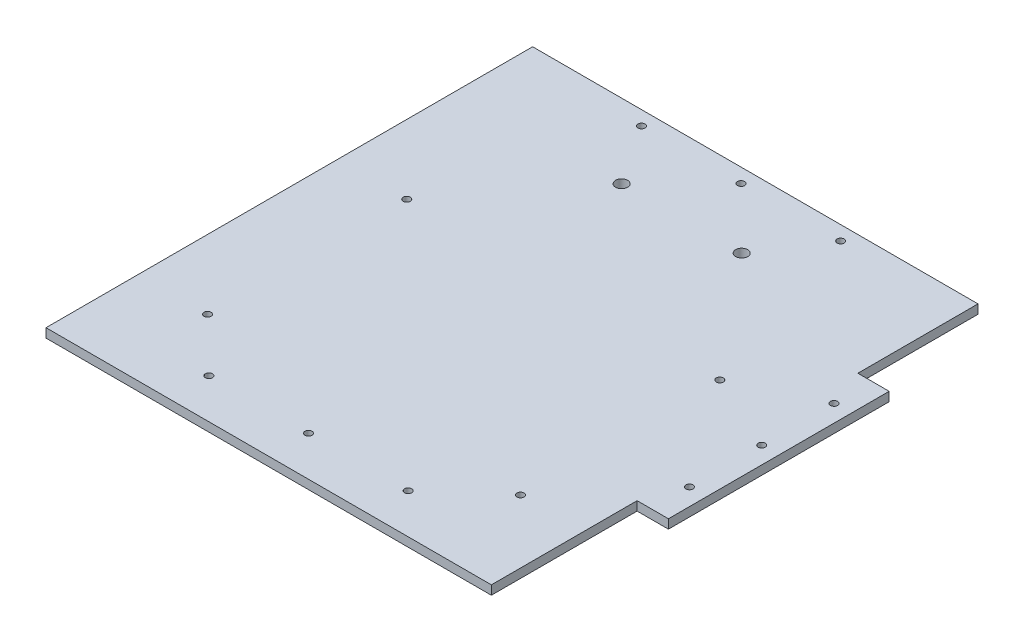
ISO-10303-21;
HEADER;
FILE_DESCRIPTION(('STEP AP214'),'2;1');
FILE_NAME('part.step','',(''),(''),'','','');
FILE_SCHEMA(('AUTOMOTIVE_DESIGN { 1 0 10303 214 1 1 1 1 }'));
ENDSEC;
DATA;
#1=APPLICATION_CONTEXT('core data for automotive mechanical design processes');
#2=APPLICATION_PROTOCOL_DEFINITION('international standard','automotive_design',2000,#1);
#3=PRODUCT_CONTEXT('',#1,'mechanical');
#4=PRODUCT('Part','Part','',(#3));
#5=PRODUCT_RELATED_PRODUCT_CATEGORY('part','',(#4));
#6=PRODUCT_DEFINITION_FORMATION('','',#4);
#7=PRODUCT_DEFINITION_CONTEXT('part definition',#1,'design');
#8=PRODUCT_DEFINITION('design','',#6,#7);
#9=PRODUCT_DEFINITION_SHAPE('','',#8);
#10=(LENGTH_UNIT() NAMED_UNIT(*) SI_UNIT(.MILLI.,.METRE.));
#11=(NAMED_UNIT(*) PLANE_ANGLE_UNIT() SI_UNIT($,.RADIAN.));
#12=(NAMED_UNIT(*) SI_UNIT($,.STERADIAN.) SOLID_ANGLE_UNIT());
#13=UNCERTAINTY_MEASURE_WITH_UNIT(LENGTH_MEASURE(1.E-05),#10,'distance_accuracy_value','');
#14=(GEOMETRIC_REPRESENTATION_CONTEXT(3) GLOBAL_UNCERTAINTY_ASSIGNED_CONTEXT((#13)) GLOBAL_UNIT_ASSIGNED_CONTEXT((#10,
#11,#12)) REPRESENTATION_CONTEXT('',''));
#15=CARTESIAN_POINT('',(0.,0.,0.));
#16=DIRECTION('',(0.,0.,1.));
#17=DIRECTION('',(1.,0.,0.));
#18=AXIS2_PLACEMENT_3D('',#15,#16,#17);
#19=CARTESIAN_POINT('',(156.499999999998,-6.35,171.));
#20=DIRECTION('',(1.,0.,0.));
#21=DIRECTION('',(0.,0.,-1.));
#22=AXIS2_PLACEMENT_3D('',#19,#20,#21);
#23=PLANE('',#22);
#24=DIRECTION('',(0.,0.,-1.));
#25=VECTOR('',#24,1.);
#26=CARTESIAN_POINT('',(156.499999999998,-6.35,171.));
#27=LINE('',#26,#25);
#28=CARTESIAN_POINT('',(156.499999999998,-6.35,171.));
#29=VERTEX_POINT('',#28);
#30=CARTESIAN_POINT('',(156.499999999998,-6.35,68.570201764885));
#31=VERTEX_POINT('',#30);
#32=EDGE_CURVE('E147',#29,#31,#27,.T.);
#33=ORIENTED_EDGE('',*,*,#32,.T.);
#34=DIRECTION('',(0.,1.,0.));
#35=VECTOR('',#34,1.);
#36=CARTESIAN_POINT('',(156.499999999998,-6.35,68.570201764885));
#37=LINE('',#36,#35);
#38=CARTESIAN_POINT('',(156.499999999998,0.,68.570201764885));
#39=VERTEX_POINT('',#38);
#40=EDGE_CURVE('E129',#31,#39,#37,.T.);
#41=ORIENTED_EDGE('',*,*,#40,.T.);
#42=DIRECTION('',(0.,0.,-1.));
#43=VECTOR('',#42,1.);
#44=CARTESIAN_POINT('',(156.499999999998,0.,171.));
#45=LINE('',#44,#43);
#46=CARTESIAN_POINT('',(156.499999999998,0.,171.));
#47=VERTEX_POINT('',#46);
#48=EDGE_CURVE('E157',#47,#39,#45,.T.);
#49=ORIENTED_EDGE('',*,*,#48,.F.);
#50=DIRECTION('',(0.,1.,0.));
#51=VECTOR('',#50,1.);
#52=CARTESIAN_POINT('',(156.499999999998,-6.35,171.));
#53=LINE('',#52,#51);
#54=EDGE_CURVE('E11',#29,#47,#53,.T.);
#55=ORIENTED_EDGE('',*,*,#54,.F.);
#56=EDGE_LOOP('',(#33,#41,#49,#55));
#57=FACE_BOUND('',#56,.T.);
#58=ADVANCED_FACE('F36',(#57),#23,.T.);
#59=DIRECTION('',(0.,1.,0.));
#60=VECTOR('',#59,1.);
#61=CARTESIAN_POINT('',(156.499999999998,-6.35,-86.570201764878));
#62=LINE('',#61,#60);
#63=CARTESIAN_POINT('',(156.499999999998,-6.35,-86.570201764878));
#64=VERTEX_POINT('',#63);
#65=CARTESIAN_POINT('',(156.499999999998,0.,-86.570201764878));
#66=VERTEX_POINT('',#65);
#67=EDGE_CURVE('E144',#64,#66,#62,.T.);
#68=ORIENTED_EDGE('',*,*,#67,.F.);
#69=CARTESIAN_POINT('',(156.499999999998,-6.35,-171.));
#70=VERTEX_POINT('',#69);
#71=EDGE_CURVE('E87',#64,#70,#27,.T.);
#72=ORIENTED_EDGE('',*,*,#71,.T.);
#73=DIRECTION('',(0.,1.,0.));
#74=VECTOR('',#73,1.);
#75=CARTESIAN_POINT('',(156.499999999998,-6.35,-171.));
#76=LINE('',#75,#74);
#77=CARTESIAN_POINT('',(156.499999999998,0.,-171.));
#78=VERTEX_POINT('',#77);
#79=EDGE_CURVE('E40',#70,#78,#76,.T.);
#80=ORIENTED_EDGE('',*,*,#79,.T.);
#81=EDGE_CURVE('E143',#66,#78,#45,.T.);
#82=ORIENTED_EDGE('',*,*,#81,.F.);
#83=EDGE_LOOP('',(#68,#72,#80,#82));
#84=FACE_BOUND('',#83,.T.);
#85=ADVANCED_FACE('F38',(#84),#23,.T.);
#86=CARTESIAN_POINT('',(-156.500000000002,-6.35,171.));
#87=DIRECTION('',(0.,0.,1.));
#88=DIRECTION('',(1.,0.,0.));
#89=AXIS2_PLACEMENT_3D('',#86,#87,#88);
#90=PLANE('',#89);
#91=DIRECTION('',(1.,0.,0.));
#92=VECTOR('',#91,1.);
#93=CARTESIAN_POINT('',(-156.500000000002,0.,171.));
#94=LINE('',#93,#92);
#95=CARTESIAN_POINT('',(-156.500000000002,0.,171.));
#96=VERTEX_POINT('',#95);
#97=EDGE_CURVE('E166',#96,#47,#94,.T.);
#98=ORIENTED_EDGE('',*,*,#97,.F.);
#99=DIRECTION('',(0.,1.,0.));
#100=VECTOR('',#99,1.);
#101=CARTESIAN_POINT('',(-156.500000000002,-6.35,171.));
#102=LINE('',#101,#100);
#103=CARTESIAN_POINT('',(-156.500000000002,-6.35,171.));
#104=VERTEX_POINT('',#103);
#105=EDGE_CURVE('E45',#104,#96,#102,.T.);
#106=ORIENTED_EDGE('',*,*,#105,.F.);
#107=DIRECTION('',(1.,0.,0.));
#108=VECTOR('',#107,1.);
#109=CARTESIAN_POINT('',(-156.500000000002,-6.35,171.));
#110=LINE('',#109,#108);
#111=EDGE_CURVE('E155',#104,#29,#110,.T.);
#112=ORIENTED_EDGE('',*,*,#111,.T.);
#113=ORIENTED_EDGE('',*,*,#54,.T.);
#114=EDGE_LOOP('',(#98,#106,#112,#113));
#115=FACE_BOUND('',#114,.T.);
#116=ADVANCED_FACE('F186',(#115),#90,.T.);
#117=CARTESIAN_POINT('',(-156.500000000002,-6.35,171.));
#118=DIRECTION('',(-1.,0.,0.));
#119=DIRECTION('',(0.,0.,1.));
#120=AXIS2_PLACEMENT_3D('',#117,#118,#119);
#121=PLANE('',#120);
#122=DIRECTION('',(0.,0.,1.));
#123=VECTOR('',#122,1.);
#124=CARTESIAN_POINT('',(-156.500000000002,0.,171.));
#125=LINE('',#124,#123);
#126=CARTESIAN_POINT('',(-156.500000000002,0.,-171.));
#127=VERTEX_POINT('',#126);
#128=EDGE_CURVE('E163',#127,#96,#125,.T.);
#129=ORIENTED_EDGE('',*,*,#128,.F.);
#130=DIRECTION('',(0.,1.,0.));
#131=VECTOR('',#130,1.);
#132=CARTESIAN_POINT('',(-156.500000000002,-6.35,-171.));
#133=LINE('',#132,#131);
#134=CARTESIAN_POINT('',(-156.500000000002,-6.35,-171.));
#135=VERTEX_POINT('',#134);
#136=EDGE_CURVE('E169',#135,#127,#133,.T.);
#137=ORIENTED_EDGE('',*,*,#136,.F.);
#138=DIRECTION('',(0.,0.,1.));
#139=VECTOR('',#138,1.);
#140=CARTESIAN_POINT('',(-156.500000000002,-6.35,171.));
#141=LINE('',#140,#139);
#142=EDGE_CURVE('E152',#135,#104,#141,.T.);
#143=ORIENTED_EDGE('',*,*,#142,.T.);
#144=ORIENTED_EDGE('',*,*,#105,.T.);
#145=EDGE_LOOP('',(#129,#137,#143,#144));
#146=FACE_BOUND('',#145,.T.);
#147=ADVANCED_FACE('F185',(#146),#121,.T.);
#148=CARTESIAN_POINT('',(-156.500000000002,-6.35,-171.));
#149=DIRECTION('',(0.,0.,-1.));
#150=DIRECTION('',(-1.,0.,0.));
#151=AXIS2_PLACEMENT_3D('',#148,#149,#150);
#152=PLANE('',#151);
#153=DIRECTION('',(-1.,0.,0.));
#154=VECTOR('',#153,1.);
#155=CARTESIAN_POINT('',(-156.500000000002,0.,-171.));
#156=LINE('',#155,#154);
#157=EDGE_CURVE('E160',#78,#127,#156,.T.);
#158=ORIENTED_EDGE('',*,*,#157,.F.);
#159=ORIENTED_EDGE('',*,*,#79,.F.);
#160=DIRECTION('',(-1.,0.,0.));
#161=VECTOR('',#160,1.);
#162=CARTESIAN_POINT('',(-156.500000000002,-6.35,-171.));
#163=LINE('',#162,#161);
#164=EDGE_CURVE('E149',#70,#135,#163,.T.);
#165=ORIENTED_EDGE('',*,*,#164,.T.);
#166=ORIENTED_EDGE('',*,*,#136,.T.);
#167=EDGE_LOOP('',(#158,#159,#165,#166));
#168=FACE_BOUND('',#167,.T.);
#169=ADVANCED_FACE('F175',(#168),#152,.T.);
#170=CARTESIAN_POINT('',(0.,-6.35,0.));
#171=DIRECTION('',(0.,-1.,0.));
#172=DIRECTION('',(0.,0.,-1.));
#173=AXIS2_PLACEMENT_3D('',#170,#171,#172);
#174=PLANE('',#173);
#175=CARTESIAN_POINT('',(112.088515786377,-6.35,-33.9344699422672));
#176=DIRECTION('',(0.,1.,0.));
#177=DIRECTION('',(0.,0.,-1.));
#178=AXIS2_PLACEMENT_3D('',#175,#176,#177);
#179=CIRCLE('',#178,2.49999999999997);
#180=CARTESIAN_POINT('',(112.088515786377,-6.35,-36.4344699422672));
#181=VERTEX_POINT('',#180);
#182=EDGE_CURVE('E288',#181,#181,#179,.T.);
#183=ORIENTED_EDGE('',*,*,#182,.T.);
#184=EDGE_LOOP('',(#183));
#185=FACE_BOUND('',#184,.T.);
#186=CARTESIAN_POINT('',(-107.911484213623,-6.35,-33.9344699422687));
#187=DIRECTION('',(0.,1.,0.));
#188=DIRECTION('',(0.,0.,-1.));
#189=AXIS2_PLACEMENT_3D('',#186,#187,#188);
#190=CIRCLE('',#189,2.50000000000005);
#191=CARTESIAN_POINT('',(-107.911484213623,-6.35,-36.4344699422688));
#192=VERTEX_POINT('',#191);
#193=EDGE_CURVE('E298',#192,#192,#190,.T.);
#194=ORIENTED_EDGE('',*,*,#193,.T.);
#195=EDGE_LOOP('',(#194));
#196=FACE_BOUND('',#195,.T.);
#197=CARTESIAN_POINT('',(-107.911484213624,-6.35,106.065530057732));
#198=DIRECTION('',(0.,1.,0.));
#199=DIRECTION('',(0.,0.,-1.));
#200=AXIS2_PLACEMENT_3D('',#197,#198,#199);
#201=CIRCLE('',#200,2.50000000000005);
#202=CARTESIAN_POINT('',(-107.911484213624,-6.35,103.565530057732));
#203=VERTEX_POINT('',#202);
#204=EDGE_CURVE('E297',#203,#203,#201,.T.);
#205=ORIENTED_EDGE('',*,*,#204,.T.);
#206=EDGE_LOOP('',(#205));
#207=FACE_BOUND('',#206,.T.);
#208=CARTESIAN_POINT('',(-41.8299625468183,-6.35,-118.867415730337));
#209=DIRECTION('',(0.,1.,0.));
#210=DIRECTION('',(0.,0.,1.));
#211=AXIS2_PLACEMENT_3D('',#208,#209,#210);
#212=CIRCLE('',#211,4.25000000000003);
#213=CARTESIAN_POINT('',(-41.8299625468183,-6.35,-114.617415730337));
#214=VERTEX_POINT('',#213);
#215=EDGE_CURVE('E307',#214,#214,#212,.T.);
#216=ORIENTED_EDGE('',*,*,#215,.T.);
#217=EDGE_LOOP('',(#216));
#218=FACE_BOUND('',#217,.T.);
#219=CARTESIAN_POINT('',(112.088515786376,-6.35,106.065530057733));
#220=DIRECTION('',(0.,1.,0.));
#221=DIRECTION('',(0.,0.,-1.));
#222=AXIS2_PLACEMENT_3D('',#219,#220,#221);
#223=CIRCLE('',#222,2.49999999999995);
#224=CARTESIAN_POINT('',(112.088515786376,-6.35,103.565530057734));
#225=VERTEX_POINT('',#224);
#226=EDGE_CURVE('E283',#225,#225,#223,.T.);
#227=ORIENTED_EDGE('',*,*,#226,.T.);
#228=EDGE_LOOP('',(#227));
#229=FACE_BOUND('',#228,.T.);
#230=CARTESIAN_POINT('',(42.5742374531818,-6.35,-118.867415730336));
#231=DIRECTION('',(0.,1.,0.));
#232=DIRECTION('',(0.,0.,-1.));
#233=AXIS2_PLACEMENT_3D('',#230,#231,#232);
#234=CIRCLE('',#233,4.25000000000001);
#235=CARTESIAN_POINT('',(42.5742374531818,-6.35,-123.117415730336));
#236=VERTEX_POINT('',#235);
#237=EDGE_CURVE('E315',#236,#236,#234,.T.);
#238=ORIENTED_EDGE('',*,*,#237,.T.);
#239=EDGE_LOOP('',(#238));
#240=FACE_BOUND('',#239,.T.);
#241=CARTESIAN_POINT('',(-70.,-6.35,143.000000000004));
#242=DIRECTION('',(0.,1.,0.));
#243=DIRECTION('',(0.,0.,1.));
#244=AXIS2_PLACEMENT_3D('',#241,#242,#243);
#245=CIRCLE('',#244,2.5);
#246=CARTESIAN_POINT('',(-70.,-6.35,145.500000000004));
#247=VERTEX_POINT('',#246);
#248=EDGE_CURVE('E331',#247,#247,#245,.T.);
#249=ORIENTED_EDGE('',*,*,#248,.T.);
#250=EDGE_LOOP('',(#249));
#251=FACE_BOUND('',#250,.T.);
#252=CARTESIAN_POINT('',(70.,-6.35,143.000000000004));
#253=DIRECTION('',(0.,1.,0.));
#254=DIRECTION('',(0.,0.,-1.));
#255=AXIS2_PLACEMENT_3D('',#252,#253,#254);
#256=CIRCLE('',#255,2.5);
#257=CARTESIAN_POINT('',(70.,-6.35,140.500000000004));
#258=VERTEX_POINT('',#257);
#259=EDGE_CURVE('E337',#258,#258,#256,.T.);
#260=ORIENTED_EDGE('',*,*,#259,.T.);
#261=EDGE_LOOP('',(#260));
#262=FACE_BOUND('',#261,.T.);
#263=CARTESIAN_POINT('',(-70.,-6.35,-160.999999999996));
#264=DIRECTION('',(0.,1.,0.));
#265=DIRECTION('',(0.,0.,-1.));
#266=AXIS2_PLACEMENT_3D('',#263,#264,#265);
#267=CIRCLE('',#266,2.50000000000001);
#268=CARTESIAN_POINT('',(-70.,-6.35,-163.499999999996));
#269=VERTEX_POINT('',#268);
#270=EDGE_CURVE('E343',#269,#269,#267,.T.);
#271=ORIENTED_EDGE('',*,*,#270,.T.);
#272=EDGE_LOOP('',(#271));
#273=FACE_BOUND('',#272,.T.);
#274=CARTESIAN_POINT('',(0.,-6.35,-160.999999999996));
#275=DIRECTION('',(0.,1.,0.));
#276=DIRECTION('',(0.,0.,-1.));
#277=AXIS2_PLACEMENT_3D('',#274,#275,#276);
#278=CIRCLE('',#277,2.49999999999999);
#279=CARTESIAN_POINT('',(0.,-6.35,-163.499999999996));
#280=VERTEX_POINT('',#279);
#281=EDGE_CURVE('E324',#280,#280,#278,.T.);
#282=ORIENTED_EDGE('',*,*,#281,.T.);
#283=EDGE_LOOP('',(#282));
#284=FACE_BOUND('',#283,.T.);
#285=CARTESIAN_POINT('',(70.,-6.35,-160.999999999996));
#286=DIRECTION('',(0.,1.,0.));
#287=DIRECTION('',(0.,0.,1.));
#288=AXIS2_PLACEMENT_3D('',#285,#286,#287);
#289=CIRCLE('',#288,2.50000000000001);
#290=CARTESIAN_POINT('',(70.,-6.35,-158.499999999996));
#291=VERTEX_POINT('',#290);
#292=EDGE_CURVE('E318',#291,#291,#289,.T.);
#293=ORIENTED_EDGE('',*,*,#292,.T.);
#294=EDGE_LOOP('',(#293));
#295=FACE_BOUND('',#294,.T.);
#296=CARTESIAN_POINT('',(0.,-6.35,143.000000000004));
#297=DIRECTION('',(0.,1.,0.));
#298=DIRECTION('',(0.,0.,1.));
#299=AXIS2_PLACEMENT_3D('',#296,#297,#298);
#300=CIRCLE('',#299,2.5);
#301=CARTESIAN_POINT('',(0.,-6.35,145.500000000004));
#302=VERTEX_POINT('',#301);
#303=EDGE_CURVE('E351',#302,#302,#300,.T.);
#304=ORIENTED_EDGE('',*,*,#303,.T.);
#305=EDGE_LOOP('',(#304));
#306=FACE_BOUND('',#305,.T.);
#307=ORIENTED_EDGE('',*,*,#32,.F.);
#308=ORIENTED_EDGE('',*,*,#111,.F.);
#309=ORIENTED_EDGE('',*,*,#142,.F.);
#310=ORIENTED_EDGE('',*,*,#164,.F.);
#311=ORIENTED_EDGE('',*,*,#71,.F.);
#312=DIRECTION('',(-1.,0.,0.));
#313=VECTOR('',#312,1.);
#314=CARTESIAN_POINT('',(178.499999999998,-6.35,-86.570201764878));
#315=LINE('',#314,#313);
#316=CARTESIAN_POINT('',(178.499999999998,-6.35,-86.570201764878));
#317=VERTEX_POINT('',#316);
#318=EDGE_CURVE('E119',#317,#64,#315,.T.);
#319=ORIENTED_EDGE('',*,*,#318,.F.);
#320=DIRECTION('',(0.,0.,-1.));
#321=VECTOR('',#320,1.);
#322=CARTESIAN_POINT('',(178.499999999998,-6.35,68.570201764885));
#323=LINE('',#322,#321);
#324=CARTESIAN_POINT('',(178.499999999998,-6.35,68.570201764885));
#325=VERTEX_POINT('',#324);
#326=EDGE_CURVE('E114',#325,#317,#323,.T.);
#327=ORIENTED_EDGE('',*,*,#326,.F.);
#328=DIRECTION('',(1.,0.,0.));
#329=VECTOR('',#328,1.);
#330=CARTESIAN_POINT('',(156.499999999998,-6.35,68.570201764885));
#331=LINE('',#330,#329);
#332=EDGE_CURVE('E126',#31,#325,#331,.T.);
#333=ORIENTED_EDGE('',*,*,#332,.F.);
#334=EDGE_LOOP('',(#307,#308,#309,#310,#311,#319,#327,#333));
#335=FACE_BOUND('',#334,.T.);
#336=CARTESIAN_POINT('',(166.499999999998,-6.35,-59.7999999999965));
#337=DIRECTION('',(0.,1.,0.));
#338=DIRECTION('',(0.,0.,-1.));
#339=AXIS2_PLACEMENT_3D('',#336,#337,#338);
#340=CIRCLE('',#339,2.5);
#341=CARTESIAN_POINT('',(166.499999999998,-6.35,-62.2999999999965));
#342=VERTEX_POINT('',#341);
#343=EDGE_CURVE('E357',#342,#342,#340,.T.);
#344=ORIENTED_EDGE('',*,*,#343,.T.);
#345=EDGE_LOOP('',(#344));
#346=FACE_BOUND('',#345,.T.);
#347=CARTESIAN_POINT('',(166.499999999998,-6.35,41.8000000000035));
#348=DIRECTION('',(0.,1.,0.));
#349=DIRECTION('',(0.,0.,1.));
#350=AXIS2_PLACEMENT_3D('',#347,#348,#349);
#351=CIRCLE('',#350,2.5);
#352=CARTESIAN_POINT('',(166.499999999998,-6.35,44.3000000000035));
#353=VERTEX_POINT('',#352);
#354=EDGE_CURVE('E363',#353,#353,#351,.T.);
#355=ORIENTED_EDGE('',*,*,#354,.T.);
#356=EDGE_LOOP('',(#355));
#357=FACE_BOUND('',#356,.T.);
#358=CARTESIAN_POINT('',(166.499999999998,-6.35,-8.99999999999648));
#359=DIRECTION('',(0.,1.,0.));
#360=DIRECTION('',(0.,0.,1.));
#361=AXIS2_PLACEMENT_3D('',#358,#359,#360);
#362=CIRCLE('',#361,2.5);
#363=CARTESIAN_POINT('',(166.499999999998,-6.35,-6.49999999999649));
#364=VERTEX_POINT('',#363);
#365=EDGE_CURVE('E140',#364,#364,#362,.T.);
#366=ORIENTED_EDGE('',*,*,#365,.T.);
#367=EDGE_LOOP('',(#366));
#368=FACE_BOUND('',#367,.T.);
#369=ADVANCED_FACE('F124',(#185,#196,#207,#218,#229,#240,#251,#262,#273,#284,#295,#306,#335,
#346,#357,#368),#174,.T.);
#370=CARTESIAN_POINT('',(0.,0.,0.));
#371=DIRECTION('',(0.,-1.,0.));
#372=DIRECTION('',(0.,0.,-1.));
#373=AXIS2_PLACEMENT_3D('',#370,#371,#372);
#374=PLANE('',#373);
#375=CARTESIAN_POINT('',(112.088515786377,0.,-33.9344699422672));
#376=DIRECTION('',(0.,1.,0.));
#377=DIRECTION('',(0.,0.,-1.));
#378=AXIS2_PLACEMENT_3D('',#375,#376,#377);
#379=CIRCLE('',#378,2.49999999999997);
#380=CARTESIAN_POINT('',(112.088515786377,0.,-36.4344699422672));
#381=VERTEX_POINT('',#380);
#382=EDGE_CURVE('E290',#381,#381,#379,.T.);
#383=ORIENTED_EDGE('',*,*,#382,.F.);
#384=EDGE_LOOP('',(#383));
#385=FACE_BOUND('',#384,.T.);
#386=CARTESIAN_POINT('',(-107.911484213623,0.,-33.9344699422687));
#387=DIRECTION('',(0.,1.,0.));
#388=DIRECTION('',(0.,0.,-1.));
#389=AXIS2_PLACEMENT_3D('',#386,#387,#388);
#390=CIRCLE('',#389,2.50000000000005);
#391=CARTESIAN_POINT('',(-107.911484213623,0.,-36.4344699422688));
#392=VERTEX_POINT('',#391);
#393=EDGE_CURVE('E294',#392,#392,#390,.T.);
#394=ORIENTED_EDGE('',*,*,#393,.F.);
#395=EDGE_LOOP('',(#394));
#396=FACE_BOUND('',#395,.T.);
#397=CARTESIAN_POINT('',(-107.911484213624,0.,106.065530057732));
#398=DIRECTION('',(0.,1.,0.));
#399=DIRECTION('',(0.,0.,-1.));
#400=AXIS2_PLACEMENT_3D('',#397,#398,#399);
#401=CIRCLE('',#400,2.50000000000005);
#402=CARTESIAN_POINT('',(-107.911484213624,0.,103.565530057732));
#403=VERTEX_POINT('',#402);
#404=EDGE_CURVE('E310',#403,#403,#401,.T.);
#405=ORIENTED_EDGE('',*,*,#404,.F.);
#406=EDGE_LOOP('',(#405));
#407=FACE_BOUND('',#406,.T.);
#408=CARTESIAN_POINT('',(-41.8299625468183,0.,-118.867415730337));
#409=DIRECTION('',(0.,1.,0.));
#410=DIRECTION('',(0.,0.,1.));
#411=AXIS2_PLACEMENT_3D('',#408,#409,#410);
#412=CIRCLE('',#411,4.25000000000003);
#413=CARTESIAN_POINT('',(-41.8299625468183,0.,-114.617415730337));
#414=VERTEX_POINT('',#413);
#415=EDGE_CURVE('E303',#414,#414,#412,.T.);
#416=ORIENTED_EDGE('',*,*,#415,.F.);
#417=EDGE_LOOP('',(#416));
#418=FACE_BOUND('',#417,.T.);
#419=CARTESIAN_POINT('',(112.088515786376,0.,106.065530057733));
#420=DIRECTION('',(0.,1.,0.));
#421=DIRECTION('',(0.,0.,-1.));
#422=AXIS2_PLACEMENT_3D('',#419,#420,#421);
#423=CIRCLE('',#422,2.49999999999995);
#424=CARTESIAN_POINT('',(112.088515786376,0.,103.565530057734));
#425=VERTEX_POINT('',#424);
#426=EDGE_CURVE('E286',#425,#425,#423,.T.);
#427=ORIENTED_EDGE('',*,*,#426,.F.);
#428=EDGE_LOOP('',(#427));
#429=FACE_BOUND('',#428,.T.);
#430=CARTESIAN_POINT('',(42.5742374531818,0.,-118.867415730336));
#431=DIRECTION('',(0.,1.,0.));
#432=DIRECTION('',(0.,0.,-1.));
#433=AXIS2_PLACEMENT_3D('',#430,#431,#432);
#434=CIRCLE('',#433,4.25000000000001);
#435=CARTESIAN_POINT('',(42.5742374531818,0.,-123.117415730336));
#436=VERTEX_POINT('',#435);
#437=EDGE_CURVE('E306',#436,#436,#434,.T.);
#438=ORIENTED_EDGE('',*,*,#437,.F.);
#439=EDGE_LOOP('',(#438));
#440=FACE_BOUND('',#439,.T.);
#441=CARTESIAN_POINT('',(-70.,0.,143.000000000004));
#442=DIRECTION('',(0.,1.,0.));
#443=DIRECTION('',(0.,0.,1.));
#444=AXIS2_PLACEMENT_3D('',#441,#442,#443);
#445=CIRCLE('',#444,2.5);
#446=CARTESIAN_POINT('',(-70.,0.,145.500000000004));
#447=VERTEX_POINT('',#446);
#448=EDGE_CURVE('E327',#447,#447,#445,.T.);
#449=ORIENTED_EDGE('',*,*,#448,.F.);
#450=EDGE_LOOP('',(#449));
#451=FACE_BOUND('',#450,.T.);
#452=CARTESIAN_POINT('',(70.,0.,143.000000000004));
#453=DIRECTION('',(0.,1.,0.));
#454=DIRECTION('',(0.,0.,-1.));
#455=AXIS2_PLACEMENT_3D('',#452,#453,#454);
#456=CIRCLE('',#455,2.5);
#457=CARTESIAN_POINT('',(70.,0.,140.500000000004));
#458=VERTEX_POINT('',#457);
#459=EDGE_CURVE('E334',#458,#458,#456,.T.);
#460=ORIENTED_EDGE('',*,*,#459,.F.);
#461=EDGE_LOOP('',(#460));
#462=FACE_BOUND('',#461,.T.);
#463=CARTESIAN_POINT('',(-70.,0.,-160.999999999996));
#464=DIRECTION('',(0.,1.,0.));
#465=DIRECTION('',(0.,0.,-1.));
#466=AXIS2_PLACEMENT_3D('',#463,#464,#465);
#467=CIRCLE('',#466,2.50000000000001);
#468=CARTESIAN_POINT('',(-70.,0.,-163.499999999996));
#469=VERTEX_POINT('',#468);
#470=EDGE_CURVE('E340',#469,#469,#467,.T.);
#471=ORIENTED_EDGE('',*,*,#470,.F.);
#472=EDGE_LOOP('',(#471));
#473=FACE_BOUND('',#472,.T.);
#474=CARTESIAN_POINT('',(0.,0.,-160.999999999996));
#475=DIRECTION('',(0.,1.,0.));
#476=DIRECTION('',(0.,0.,-1.));
#477=AXIS2_PLACEMENT_3D('',#474,#475,#476);
#478=CIRCLE('',#477,2.49999999999999);
#479=CARTESIAN_POINT('',(0.,0.,-163.499999999996));
#480=VERTEX_POINT('',#479);
#481=EDGE_CURVE('E346',#480,#480,#478,.T.);
#482=ORIENTED_EDGE('',*,*,#481,.F.);
#483=EDGE_LOOP('',(#482));
#484=FACE_BOUND('',#483,.T.);
#485=CARTESIAN_POINT('',(70.,0.,-160.999999999996));
#486=DIRECTION('',(0.,1.,0.));
#487=DIRECTION('',(0.,0.,1.));
#488=AXIS2_PLACEMENT_3D('',#485,#486,#487);
#489=CIRCLE('',#488,2.50000000000001);
#490=CARTESIAN_POINT('',(70.,0.,-158.499999999996));
#491=VERTEX_POINT('',#490);
#492=EDGE_CURVE('E321',#491,#491,#489,.T.);
#493=ORIENTED_EDGE('',*,*,#492,.F.);
#494=EDGE_LOOP('',(#493));
#495=FACE_BOUND('',#494,.T.);
#496=CARTESIAN_POINT('',(0.,0.,143.000000000004));
#497=DIRECTION('',(0.,1.,0.));
#498=DIRECTION('',(0.,0.,1.));
#499=AXIS2_PLACEMENT_3D('',#496,#497,#498);
#500=CIRCLE('',#499,2.5);
#501=CARTESIAN_POINT('',(0.,0.,145.500000000004));
#502=VERTEX_POINT('',#501);
#503=EDGE_CURVE('E330',#502,#502,#500,.T.);
#504=ORIENTED_EDGE('',*,*,#503,.F.);
#505=EDGE_LOOP('',(#504));
#506=FACE_BOUND('',#505,.T.);
#507=ORIENTED_EDGE('',*,*,#48,.T.);
#508=DIRECTION('',(1.,0.,0.));
#509=VECTOR('',#508,1.);
#510=CARTESIAN_POINT('',(156.499999999998,0.,68.570201764885));
#511=LINE('',#510,#509);
#512=CARTESIAN_POINT('',(178.499999999998,0.,68.570201764885));
#513=VERTEX_POINT('',#512);
#514=EDGE_CURVE('E53',#39,#513,#511,.T.);
#515=ORIENTED_EDGE('',*,*,#514,.T.);
#516=DIRECTION('',(0.,0.,-1.));
#517=VECTOR('',#516,1.);
#518=CARTESIAN_POINT('',(178.499999999998,0.,68.570201764885));
#519=LINE('',#518,#517);
#520=CARTESIAN_POINT('',(178.499999999998,0.,-86.570201764878));
#521=VERTEX_POINT('',#520);
#522=EDGE_CURVE('E116',#513,#521,#519,.T.);
#523=ORIENTED_EDGE('',*,*,#522,.T.);
#524=DIRECTION('',(-1.,0.,0.));
#525=VECTOR('',#524,1.);
#526=CARTESIAN_POINT('',(178.499999999998,0.,-86.570201764878));
#527=LINE('',#526,#525);
#528=EDGE_CURVE('E130',#521,#66,#527,.T.);
#529=ORIENTED_EDGE('',*,*,#528,.T.);
#530=ORIENTED_EDGE('',*,*,#81,.T.);
#531=ORIENTED_EDGE('',*,*,#157,.T.);
#532=ORIENTED_EDGE('',*,*,#128,.T.);
#533=ORIENTED_EDGE('',*,*,#97,.T.);
#534=EDGE_LOOP('',(#507,#515,#523,#529,#530,#531,#532,#533));
#535=FACE_BOUND('',#534,.T.);
#536=CARTESIAN_POINT('',(166.499999999998,0.,-59.7999999999965));
#537=DIRECTION('',(0.,1.,0.));
#538=DIRECTION('',(0.,0.,-1.));
#539=AXIS2_PLACEMENT_3D('',#536,#537,#538);
#540=CIRCLE('',#539,2.5);
#541=CARTESIAN_POINT('',(166.499999999998,0.,-62.2999999999965));
#542=VERTEX_POINT('',#541);
#543=EDGE_CURVE('E354',#542,#542,#540,.T.);
#544=ORIENTED_EDGE('',*,*,#543,.F.);
#545=EDGE_LOOP('',(#544));
#546=FACE_BOUND('',#545,.T.);
#547=CARTESIAN_POINT('',(166.499999999998,0.,41.8000000000035));
#548=DIRECTION('',(0.,1.,0.));
#549=DIRECTION('',(0.,0.,1.));
#550=AXIS2_PLACEMENT_3D('',#547,#548,#549);
#551=CIRCLE('',#550,2.5);
#552=CARTESIAN_POINT('',(166.499999999998,0.,44.3000000000035));
#553=VERTEX_POINT('',#552);
#554=EDGE_CURVE('E360',#553,#553,#551,.T.);
#555=ORIENTED_EDGE('',*,*,#554,.F.);
#556=EDGE_LOOP('',(#555));
#557=FACE_BOUND('',#556,.T.);
#558=CARTESIAN_POINT('',(166.499999999998,0.,-8.99999999999648));
#559=DIRECTION('',(0.,1.,0.));
#560=DIRECTION('',(0.,0.,1.));
#561=AXIS2_PLACEMENT_3D('',#558,#559,#560);
#562=CIRCLE('',#561,2.5);
#563=CARTESIAN_POINT('',(166.499999999998,0.,-6.49999999999649));
#564=VERTEX_POINT('',#563);
#565=EDGE_CURVE('E135',#564,#564,#562,.T.);
#566=ORIENTED_EDGE('',*,*,#565,.F.);
#567=EDGE_LOOP('',(#566));
#568=FACE_BOUND('',#567,.T.);
#569=ADVANCED_FACE('F177',(#385,#396,#407,#418,#429,#440,#451,#462,#473,#484,#495,#506,#535,
#546,#557,#568),#374,.F.);
#570=CARTESIAN_POINT('',(156.499999999998,-6.35,68.570201764885));
#571=DIRECTION('',(0.,0.,1.));
#572=DIRECTION('',(1.,0.,0.));
#573=AXIS2_PLACEMENT_3D('',#570,#571,#572);
#574=PLANE('',#573);
#575=ORIENTED_EDGE('',*,*,#514,.F.);
#576=ORIENTED_EDGE('',*,*,#40,.F.);
#577=ORIENTED_EDGE('',*,*,#332,.T.);
#578=DIRECTION('',(0.,1.,0.));
#579=VECTOR('',#578,1.);
#580=CARTESIAN_POINT('',(178.499999999998,-6.35,68.570201764885));
#581=LINE('',#580,#579);
#582=EDGE_CURVE('E111',#325,#513,#581,.T.);
#583=ORIENTED_EDGE('',*,*,#582,.T.);
#584=EDGE_LOOP('',(#575,#576,#577,#583));
#585=FACE_BOUND('',#584,.T.);
#586=ADVANCED_FACE('F128',(#585),#574,.T.);
#587=CARTESIAN_POINT('',(178.499999999998,-6.35,-86.570201764878));
#588=DIRECTION('',(0.,0.,-1.));
#589=DIRECTION('',(-1.,0.,0.));
#590=AXIS2_PLACEMENT_3D('',#587,#588,#589);
#591=PLANE('',#590);
#592=ORIENTED_EDGE('',*,*,#528,.F.);
#593=DIRECTION('',(0.,1.,0.));
#594=VECTOR('',#593,1.);
#595=CARTESIAN_POINT('',(178.499999999998,-6.35,-86.570201764878));
#596=LINE('',#595,#594);
#597=EDGE_CURVE('E118',#317,#521,#596,.T.);
#598=ORIENTED_EDGE('',*,*,#597,.F.);
#599=ORIENTED_EDGE('',*,*,#318,.T.);
#600=ORIENTED_EDGE('',*,*,#67,.T.);
#601=EDGE_LOOP('',(#592,#598,#599,#600));
#602=FACE_BOUND('',#601,.T.);
#603=ADVANCED_FACE('F181',(#602),#591,.T.);
#604=CARTESIAN_POINT('',(178.499999999998,-6.35,68.570201764885));
#605=DIRECTION('',(1.,0.,0.));
#606=DIRECTION('',(0.,0.,-1.));
#607=AXIS2_PLACEMENT_3D('',#604,#605,#606);
#608=PLANE('',#607);
#609=ORIENTED_EDGE('',*,*,#522,.F.);
#610=ORIENTED_EDGE('',*,*,#582,.F.);
#611=ORIENTED_EDGE('',*,*,#326,.T.);
#612=ORIENTED_EDGE('',*,*,#597,.T.);
#613=EDGE_LOOP('',(#609,#610,#611,#612));
#614=FACE_BOUND('',#613,.T.);
#615=ADVANCED_FACE('F113',(#614),#608,.T.);
#616=CARTESIAN_POINT('',(166.499999999998,-6.35,-8.99999999999648));
#617=DIRECTION('',(0.,1.,0.));
#618=DIRECTION('',(0.,0.,1.));
#619=AXIS2_PLACEMENT_3D('',#616,#617,#618);
#620=CYLINDRICAL_SURFACE('',#619,2.5);
#621=ORIENTED_EDGE('',*,*,#365,.F.);
#622=EDGE_LOOP('',(#621));
#623=FACE_BOUND('',#622,.T.);
#624=ORIENTED_EDGE('',*,*,#565,.T.);
#625=EDGE_LOOP('',(#624));
#626=FACE_BOUND('',#625,.T.);
#627=ADVANCED_FACE('F217',(#623,#626),#620,.F.);
#628=CARTESIAN_POINT('',(166.499999999998,-6.35,41.8000000000035));
#629=DIRECTION('',(0.,1.,0.));
#630=DIRECTION('',(0.,0.,1.));
#631=AXIS2_PLACEMENT_3D('',#628,#629,#630);
#632=CYLINDRICAL_SURFACE('',#631,2.5);
#633=ORIENTED_EDGE('',*,*,#354,.F.);
#634=EDGE_LOOP('',(#633));
#635=FACE_BOUND('',#634,.T.);
#636=ORIENTED_EDGE('',*,*,#554,.T.);
#637=EDGE_LOOP('',(#636));
#638=FACE_BOUND('',#637,.T.);
#639=ADVANCED_FACE('F222',(#635,#638),#632,.F.);
#640=CARTESIAN_POINT('',(166.499999999998,-6.35,-59.7999999999965));
#641=DIRECTION('',(0.,1.,0.));
#642=DIRECTION('',(0.,0.,1.));
#643=AXIS2_PLACEMENT_3D('',#640,#641,#642);
#644=CYLINDRICAL_SURFACE('',#643,2.5);
#645=ORIENTED_EDGE('',*,*,#343,.F.);
#646=EDGE_LOOP('',(#645));
#647=FACE_BOUND('',#646,.T.);
#648=ORIENTED_EDGE('',*,*,#543,.T.);
#649=EDGE_LOOP('',(#648));
#650=FACE_BOUND('',#649,.T.);
#651=ADVANCED_FACE('F226',(#647,#650),#644,.F.);
#652=CARTESIAN_POINT('',(0.,-6.35,143.000000000004));
#653=DIRECTION('',(0.,1.,0.));
#654=DIRECTION('',(0.,0.,1.));
#655=AXIS2_PLACEMENT_3D('',#652,#653,#654);
#656=CYLINDRICAL_SURFACE('',#655,2.5);
#657=ORIENTED_EDGE('',*,*,#303,.F.);
#658=EDGE_LOOP('',(#657));
#659=FACE_BOUND('',#658,.T.);
#660=ORIENTED_EDGE('',*,*,#503,.T.);
#661=EDGE_LOOP('',(#660));
#662=FACE_BOUND('',#661,.T.);
#663=ADVANCED_FACE('F230',(#659,#662),#656,.F.);
#664=CARTESIAN_POINT('',(70.,-6.35,-160.999999999996));
#665=DIRECTION('',(0.,1.,0.));
#666=DIRECTION('',(0.,0.,1.));
#667=AXIS2_PLACEMENT_3D('',#664,#665,#666);
#668=CYLINDRICAL_SURFACE('',#667,2.50000000000001);
#669=ORIENTED_EDGE('',*,*,#292,.F.);
#670=EDGE_LOOP('',(#669));
#671=FACE_BOUND('',#670,.T.);
#672=ORIENTED_EDGE('',*,*,#492,.T.);
#673=EDGE_LOOP('',(#672));
#674=FACE_BOUND('',#673,.T.);
#675=ADVANCED_FACE('F234',(#671,#674),#668,.F.);
#676=CARTESIAN_POINT('',(0.,-6.35,-160.999999999996));
#677=DIRECTION('',(0.,1.,0.));
#678=DIRECTION('',(0.,0.,1.));
#679=AXIS2_PLACEMENT_3D('',#676,#677,#678);
#680=CYLINDRICAL_SURFACE('',#679,2.49999999999999);
#681=ORIENTED_EDGE('',*,*,#281,.F.);
#682=EDGE_LOOP('',(#681));
#683=FACE_BOUND('',#682,.T.);
#684=ORIENTED_EDGE('',*,*,#481,.T.);
#685=EDGE_LOOP('',(#684));
#686=FACE_BOUND('',#685,.T.);
#687=ADVANCED_FACE('F236',(#683,#686),#680,.F.);
#688=CARTESIAN_POINT('',(-70.,-6.35,-160.999999999996));
#689=DIRECTION('',(0.,1.,0.));
#690=DIRECTION('',(0.,0.,1.));
#691=AXIS2_PLACEMENT_3D('',#688,#689,#690);
#692=CYLINDRICAL_SURFACE('',#691,2.50000000000001);
#693=ORIENTED_EDGE('',*,*,#270,.F.);
#694=EDGE_LOOP('',(#693));
#695=FACE_BOUND('',#694,.T.);
#696=ORIENTED_EDGE('',*,*,#470,.T.);
#697=EDGE_LOOP('',(#696));
#698=FACE_BOUND('',#697,.T.);
#699=ADVANCED_FACE('F239',(#695,#698),#692,.F.);
#700=CARTESIAN_POINT('',(70.,-6.35,143.000000000004));
#701=DIRECTION('',(0.,1.,0.));
#702=DIRECTION('',(0.,0.,1.));
#703=AXIS2_PLACEMENT_3D('',#700,#701,#702);
#704=CYLINDRICAL_SURFACE('',#703,2.5);
#705=ORIENTED_EDGE('',*,*,#259,.F.);
#706=EDGE_LOOP('',(#705));
#707=FACE_BOUND('',#706,.T.);
#708=ORIENTED_EDGE('',*,*,#459,.T.);
#709=EDGE_LOOP('',(#708));
#710=FACE_BOUND('',#709,.T.);
#711=ADVANCED_FACE('F243',(#707,#710),#704,.F.);
#712=CARTESIAN_POINT('',(-70.,-6.35,143.000000000004));
#713=DIRECTION('',(0.,1.,0.));
#714=DIRECTION('',(0.,0.,1.));
#715=AXIS2_PLACEMENT_3D('',#712,#713,#714);
#716=CYLINDRICAL_SURFACE('',#715,2.5);
#717=ORIENTED_EDGE('',*,*,#248,.F.);
#718=EDGE_LOOP('',(#717));
#719=FACE_BOUND('',#718,.T.);
#720=ORIENTED_EDGE('',*,*,#448,.T.);
#721=EDGE_LOOP('',(#720));
#722=FACE_BOUND('',#721,.T.);
#723=ADVANCED_FACE('F247',(#719,#722),#716,.F.);
#724=CARTESIAN_POINT('',(42.5742374531818,-6.35,-118.867415730336));
#725=DIRECTION('',(0.,1.,0.));
#726=DIRECTION('',(0.,0.,1.));
#727=AXIS2_PLACEMENT_3D('',#724,#725,#726);
#728=CYLINDRICAL_SURFACE('',#727,4.25000000000001);
#729=ORIENTED_EDGE('',*,*,#237,.F.);
#730=EDGE_LOOP('',(#729));
#731=FACE_BOUND('',#730,.T.);
#732=ORIENTED_EDGE('',*,*,#437,.T.);
#733=EDGE_LOOP('',(#732));
#734=FACE_BOUND('',#733,.T.);
#735=ADVANCED_FACE('F251',(#731,#734),#728,.F.);
#736=CARTESIAN_POINT('',(112.088515786376,-6.35,106.065530057733));
#737=DIRECTION('',(0.,1.,0.));
#738=DIRECTION('',(0.,0.,1.));
#739=AXIS2_PLACEMENT_3D('',#736,#737,#738);
#740=CYLINDRICAL_SURFACE('',#739,2.49999999999995);
#741=ORIENTED_EDGE('',*,*,#226,.F.);
#742=EDGE_LOOP('',(#741));
#743=FACE_BOUND('',#742,.T.);
#744=ORIENTED_EDGE('',*,*,#426,.T.);
#745=EDGE_LOOP('',(#744));
#746=FACE_BOUND('',#745,.T.);
#747=ADVANCED_FACE('F258',(#743,#746),#740,.F.);
#748=CARTESIAN_POINT('',(-41.8299625468183,-6.35,-118.867415730337));
#749=DIRECTION('',(0.,1.,0.));
#750=DIRECTION('',(0.,0.,1.));
#751=AXIS2_PLACEMENT_3D('',#748,#749,#750);
#752=CYLINDRICAL_SURFACE('',#751,4.25000000000003);
#753=ORIENTED_EDGE('',*,*,#215,.F.);
#754=EDGE_LOOP('',(#753));
#755=FACE_BOUND('',#754,.T.);
#756=ORIENTED_EDGE('',*,*,#415,.T.);
#757=EDGE_LOOP('',(#756));
#758=FACE_BOUND('',#757,.T.);
#759=ADVANCED_FACE('F264',(#755,#758),#752,.F.);
#760=CARTESIAN_POINT('',(-107.911484213624,-6.35,106.065530057732));
#761=DIRECTION('',(0.,1.,0.));
#762=DIRECTION('',(0.,0.,1.));
#763=AXIS2_PLACEMENT_3D('',#760,#761,#762);
#764=CYLINDRICAL_SURFACE('',#763,2.50000000000005);
#765=ORIENTED_EDGE('',*,*,#204,.F.);
#766=EDGE_LOOP('',(#765));
#767=FACE_BOUND('',#766,.T.);
#768=ORIENTED_EDGE('',*,*,#404,.T.);
#769=EDGE_LOOP('',(#768));
#770=FACE_BOUND('',#769,.T.);
#771=ADVANCED_FACE('F260',(#767,#770),#764,.F.);
#772=CARTESIAN_POINT('',(-107.911484213623,-6.35,-33.9344699422687));
#773=DIRECTION('',(0.,1.,0.));
#774=DIRECTION('',(0.,0.,1.));
#775=AXIS2_PLACEMENT_3D('',#772,#773,#774);
#776=CYLINDRICAL_SURFACE('',#775,2.50000000000005);
#777=ORIENTED_EDGE('',*,*,#193,.F.);
#778=EDGE_LOOP('',(#777));
#779=FACE_BOUND('',#778,.T.);
#780=ORIENTED_EDGE('',*,*,#393,.T.);
#781=EDGE_LOOP('',(#780));
#782=FACE_BOUND('',#781,.T.);
#783=ADVANCED_FACE('F263',(#779,#782),#776,.F.);
#784=CARTESIAN_POINT('',(112.088515786377,-6.35,-33.9344699422672));
#785=DIRECTION('',(0.,1.,0.));
#786=DIRECTION('',(0.,0.,1.));
#787=AXIS2_PLACEMENT_3D('',#784,#785,#786);
#788=CYLINDRICAL_SURFACE('',#787,2.49999999999997);
#789=ORIENTED_EDGE('',*,*,#182,.F.);
#790=EDGE_LOOP('',(#789));
#791=FACE_BOUND('',#790,.T.);
#792=ORIENTED_EDGE('',*,*,#382,.T.);
#793=EDGE_LOOP('',(#792));
#794=FACE_BOUND('',#793,.T.);
#795=ADVANCED_FACE('F269',(#791,#794),#788,.F.);
#796=CLOSED_SHELL('',(#58,#85,#116,#147,#169,#369,#569,#586,#603,#615,#627,#639,#651,#663,#675,
#687,#699,#711,#723,#735,#747,#759,#771,#783,#795));
#797=MANIFOLD_SOLID_BREP('B2',#796);
#798=ADVANCED_BREP_SHAPE_REPRESENTATION('',(#18,#797),#14);
#799=SHAPE_DEFINITION_REPRESENTATION(#9,#798);
ENDSEC;
END-ISO-10303-21;
